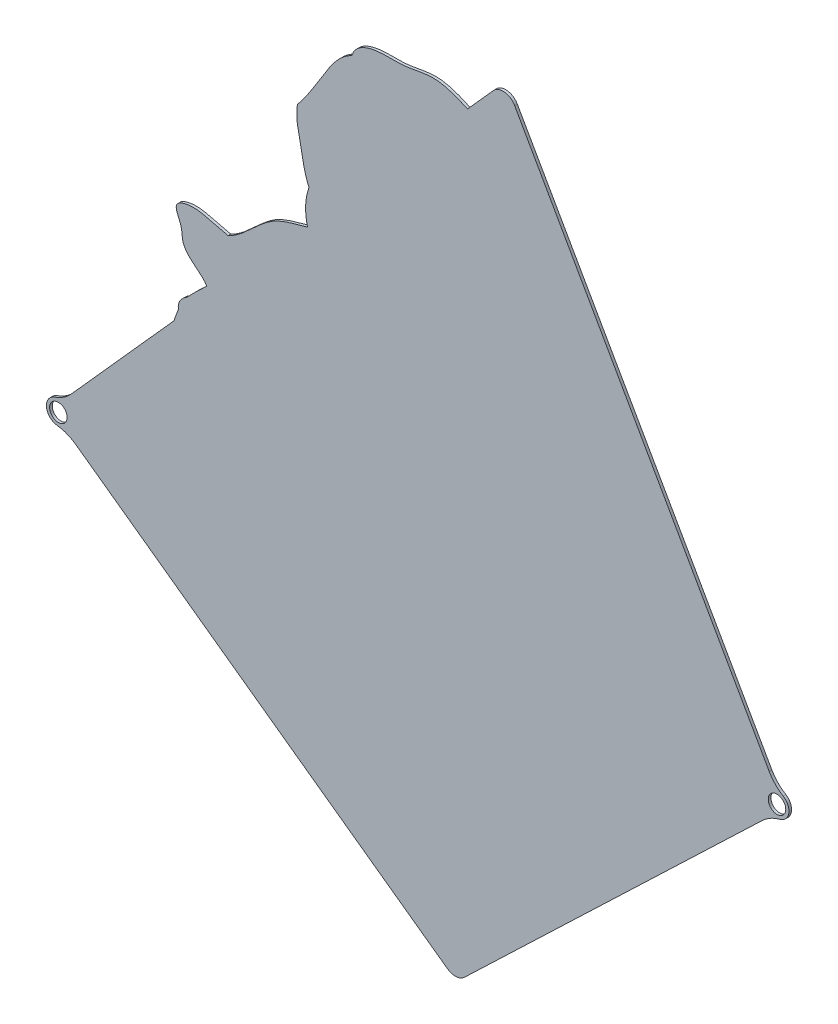
ISO-10303-21;
HEADER;
FILE_DESCRIPTION(('STEP AP214'),'2;1');
FILE_NAME('part.step','',(''),(''),'','','');
FILE_SCHEMA(('AUTOMOTIVE_DESIGN { 1 0 10303 214 1 1 1 1 }'));
ENDSEC;
DATA;
#1=APPLICATION_CONTEXT('core data for automotive mechanical design processes');
#2=APPLICATION_PROTOCOL_DEFINITION('international standard','automotive_design',2000,#1);
#3=PRODUCT_CONTEXT('',#1,'mechanical');
#4=PRODUCT('Part','Part','',(#3));
#5=PRODUCT_RELATED_PRODUCT_CATEGORY('part','',(#4));
#6=PRODUCT_DEFINITION_FORMATION('','',#4);
#7=PRODUCT_DEFINITION_CONTEXT('part definition',#1,'design');
#8=PRODUCT_DEFINITION('design','',#6,#7);
#9=PRODUCT_DEFINITION_SHAPE('','',#8);
#10=(LENGTH_UNIT() NAMED_UNIT(*) SI_UNIT(.MILLI.,.METRE.));
#11=(NAMED_UNIT(*) PLANE_ANGLE_UNIT() SI_UNIT($,.RADIAN.));
#12=(NAMED_UNIT(*) SI_UNIT($,.STERADIAN.) SOLID_ANGLE_UNIT());
#13=UNCERTAINTY_MEASURE_WITH_UNIT(LENGTH_MEASURE(1.E-05),#10,'distance_accuracy_value','');
#14=(GEOMETRIC_REPRESENTATION_CONTEXT(3) GLOBAL_UNCERTAINTY_ASSIGNED_CONTEXT((#13)) GLOBAL_UNIT_ASSIGNED_CONTEXT((#10,
#11,#12)) REPRESENTATION_CONTEXT('',''));
#15=CARTESIAN_POINT('',(0.,0.,0.));
#16=DIRECTION('',(0.,0.,1.));
#17=DIRECTION('',(1.,0.,0.));
#18=AXIS2_PLACEMENT_3D('',#15,#16,#17);
#19=CARTESIAN_POINT('',(59.9806161640926,171.840128470862,-4.));
#20=CARTESIAN_POINT('',(58.1352460402258,170.769655690411,-4.));
#21=CARTESIAN_POINT('',(56.3909211998731,168.715252621853,-4.));
#22=CARTESIAN_POINT('',(56.8872663364732,166.420330939957,-4.));
#23=B_SPLINE_CURVE_WITH_KNOTS('',3,(#19,#20,#21,#22),.UNSPECIFIED.,.F.,.F.,(4,4),(0.,1.),.UNSPECIFIED.);
#24=DIRECTION('',(0.,0.,1.));
#25=VECTOR('',#24,1.);
#26=SURFACE_OF_LINEAR_EXTRUSION('',#23,#25);
#27=CARTESIAN_POINT('',(59.9806161640926,171.840128470862,-3.));
#28=CARTESIAN_POINT('',(58.1352460402258,170.769655690411,-3.));
#29=CARTESIAN_POINT('',(56.3909211998731,168.715252621853,-3.));
#30=CARTESIAN_POINT('',(56.8872663364732,166.420330939957,-3.));
#31=B_SPLINE_CURVE_WITH_KNOTS('',3,(#27,#28,#29,#30),.UNSPECIFIED.,.F.,.F.,(4,4),(0.,1.),.UNSPECIFIED.);
#32=CARTESIAN_POINT('',(59.9806161634868,171.840128470425,-3.));
#33=VERTEX_POINT('',#32);
#34=CARTESIAN_POINT('',(56.8872663364732,166.420330939957,-3.));
#35=VERTEX_POINT('',#34);
#36=EDGE_CURVE('E352',#33,#35,#31,.T.);
#37=ORIENTED_EDGE('',*,*,#36,.F.);
#38=DIRECTION('',(0.,0.,1.));
#39=VECTOR('',#38,1.);
#40=CARTESIAN_POINT('',(59.9806161634868,171.840128470425,-4.));
#41=LINE('',#40,#39);
#42=CARTESIAN_POINT('',(59.9806161634868,171.840128470425,-4.));
#43=VERTEX_POINT('',#42);
#44=EDGE_CURVE('E11',#43,#33,#41,.T.);
#45=ORIENTED_EDGE('',*,*,#44,.F.);
#46=CARTESIAN_POINT('',(56.8872663364732,166.420330939957,-4.));
#47=VERTEX_POINT('',#46);
#48=EDGE_CURVE('E362',#43,#47,#23,.T.);
#49=ORIENTED_EDGE('',*,*,#48,.T.);
#50=DIRECTION('',(0.,0.,1.));
#51=VECTOR('',#50,1.);
#52=CARTESIAN_POINT('',(56.8872663364732,166.420330939957,-4.));
#53=LINE('',#52,#51);
#54=EDGE_CURVE('E43',#47,#35,#53,.T.);
#55=ORIENTED_EDGE('',*,*,#54,.T.);
#56=EDGE_LOOP('',(#37,#45,#49,#55));
#57=FACE_BOUND('',#56,.T.);
#58=ADVANCED_FACE('F39',(#57),#26,.T.);
#59=CARTESIAN_POINT('',(709360.629520317,-704976.409241836,-4.));
#60=CARTESIAN_POINT('',(-695963.860199664,718190.671949546,-4.));
#61=CARTESIAN_POINT('',(682824.682968235,-730699.805492577,-4.));
#62=B_SPLINE_CURVE_WITH_KNOTS('',2,(#59,#60,#61),.UNSPECIFIED.,.F.,.F.,(3,3),(0.,1.),.UNSPECIFIED.);
#63=DIRECTION('',(0.,0.,1.));
#64=VECTOR('',#63,1.);
#65=SURFACE_OF_LINEAR_EXTRUSION('',#62,#64);
#66=CARTESIAN_POINT('',(709360.629520317,-704976.409241836,-3.));
#67=CARTESIAN_POINT('',(-695963.860199664,718190.671949546,-3.));
#68=CARTESIAN_POINT('',(682824.682968235,-730699.805492577,-3.));
#69=B_SPLINE_CURVE_WITH_KNOTS('',2,(#66,#67,#68),.UNSPECIFIED.,.F.,.F.,(3,3),(0.,1.),.UNSPECIFIED.);
#70=CARTESIAN_POINT('',(67.5511590329545,179.262120632522,-3.));
#71=VERTEX_POINT('',#70);
#72=EDGE_CURVE('E360',#71,#33,#69,.T.);
#73=ORIENTED_EDGE('',*,*,#72,.F.);
#74=DIRECTION('',(0.,0.,1.));
#75=VECTOR('',#74,1.);
#76=CARTESIAN_POINT('',(67.5511590329545,179.262120632522,-4.));
#77=LINE('',#76,#75);
#78=CARTESIAN_POINT('',(67.5511590329545,179.262120632522,-4.));
#79=VERTEX_POINT('',#78);
#80=EDGE_CURVE('E50',#79,#71,#77,.T.);
#81=ORIENTED_EDGE('',*,*,#80,.F.);
#82=EDGE_CURVE('E213',#79,#43,#62,.T.);
#83=ORIENTED_EDGE('',*,*,#82,.T.);
#84=ORIENTED_EDGE('',*,*,#44,.T.);
#85=EDGE_LOOP('',(#73,#81,#83,#84));
#86=FACE_BOUND('',#85,.T.);
#87=ADVANCED_FACE('F347',(#86),#65,.T.);
#88=CARTESIAN_POINT('',(75.6084310687586,199.787338703665,-4.));
#89=CARTESIAN_POINT('',(72.9650083766247,200.448410696032,-4.));
#90=CARTESIAN_POINT('',(68.1301058964633,201.670017190916,-4.));
#91=CARTESIAN_POINT('',(62.0197575043796,202.966820343175,-4.));
#92=CARTESIAN_POINT('',(54.8350116235169,201.049857450651,-4.));
#93=CARTESIAN_POINT('',(56.9212553230008,196.431484587131,-4.));
#94=CARTESIAN_POINT('',(58.3216430822597,193.178691109802,-4.));
#95=CARTESIAN_POINT('',(58.0823213688219,189.161546227105,-4.));
#96=CARTESIAN_POINT('',(61.7573894763583,184.075704484428,-4.));
#97=CARTESIAN_POINT('',(65.8515580736938,182.053410845919,-4.));
#98=CARTESIAN_POINT('',(67.5511590329545,179.262120632522,-4.));
#99=B_SPLINE_CURVE_WITH_KNOTS('',3,(#88,#89,#90,#91,#92,#93,#94,#95,#96,#97,#98),.UNSPECIFIED.,
.F.,.F.,(4,1,1,1,1,1,1,1,4),(0.,0.185122605873872,0.320265005146591,0.454108381275894,
0.53728892639634,0.59917769050058,0.700070157561732,0.79019697526098,1.),.UNSPECIFIED.);
#100=DIRECTION('',(0.,0.,1.));
#101=VECTOR('',#100,1.);
#102=SURFACE_OF_LINEAR_EXTRUSION('',#99,#101);
#103=CARTESIAN_POINT('',(75.6084310687586,199.787338703665,-3.));
#104=CARTESIAN_POINT('',(72.9650083766247,200.448410696032,-3.));
#105=CARTESIAN_POINT('',(68.1301058964633,201.670017190916,-3.));
#106=CARTESIAN_POINT('',(62.0197575043796,202.966820343175,-3.));
#107=CARTESIAN_POINT('',(54.8350116235169,201.049857450651,-3.));
#108=CARTESIAN_POINT('',(56.9212553230008,196.431484587131,-3.));
#109=CARTESIAN_POINT('',(58.3216430822597,193.178691109802,-3.));
#110=CARTESIAN_POINT('',(58.0823213688219,189.161546227105,-3.));
#111=CARTESIAN_POINT('',(61.7573894763583,184.075704484428,-3.));
#112=CARTESIAN_POINT('',(65.8515580736938,182.053410845919,-3.));
#113=CARTESIAN_POINT('',(67.5511590329545,179.262120632522,-3.));
#114=B_SPLINE_CURVE_WITH_KNOTS('',3,(#103,#104,#105,#106,#107,#108,#109,#110,#111,#112,#113),
.UNSPECIFIED.,.F.,.F.,(4,1,1,1,1,1,1,1,4),(0.,0.185122605873872,0.320265005146591,
0.454108381275894,0.53728892639634,0.59917769050058,0.700070157561732,0.79019697526098,1.),.UNSPECIFIED.);
#115=CARTESIAN_POINT('',(75.6084310687586,199.787338703665,-3.));
#116=VERTEX_POINT('',#115);
#117=EDGE_CURVE('E199',#116,#71,#114,.T.);
#118=ORIENTED_EDGE('',*,*,#117,.F.);
#119=DIRECTION('',(0.,0.,1.));
#120=VECTOR('',#119,1.);
#121=CARTESIAN_POINT('',(75.6084310687586,199.787338703665,-4.));
#122=LINE('',#121,#120);
#123=CARTESIAN_POINT('',(75.6084310687586,199.787338703665,-4.));
#124=VERTEX_POINT('',#123);
#125=EDGE_CURVE('E194',#124,#116,#122,.T.);
#126=ORIENTED_EDGE('',*,*,#125,.F.);
#127=EDGE_CURVE('E197',#124,#79,#99,.T.);
#128=ORIENTED_EDGE('',*,*,#127,.T.);
#129=ORIENTED_EDGE('',*,*,#80,.T.);
#130=EDGE_LOOP('',(#118,#126,#128,#129));
#131=FACE_BOUND('',#130,.T.);
#132=ADVANCED_FACE('F196',(#131),#102,.T.);
#133=CARTESIAN_POINT('',(105.543362438897,217.548369999413,-4.));
#134=CARTESIAN_POINT('',(101.478949420785,216.275176704131,-4.));
#135=CARTESIAN_POINT('',(89.4383296670491,214.004143017136,-4.));
#136=CARTESIAN_POINT('',(82.364872067757,202.984357934411,-4.));
#137=CARTESIAN_POINT('',(75.6084310687586,199.787338703665,-4.));
#138=B_SPLINE_CURVE_WITH_KNOTS('',3,(#133,#134,#135,#136,#137),.UNSPECIFIED.,.F.,.F.,(4,1,4),
(0.,0.364395460525438,1.),.UNSPECIFIED.);
#139=DIRECTION('',(0.,0.,1.));
#140=VECTOR('',#139,1.);
#141=SURFACE_OF_LINEAR_EXTRUSION('',#138,#140);
#142=CARTESIAN_POINT('',(105.543362438897,217.548369999413,-3.));
#143=CARTESIAN_POINT('',(101.478949420785,216.275176704131,-3.));
#144=CARTESIAN_POINT('',(89.4383296670491,214.004143017136,-3.));
#145=CARTESIAN_POINT('',(82.364872067757,202.984357934411,-3.));
#146=CARTESIAN_POINT('',(75.6084310687586,199.787338703665,-3.));
#147=B_SPLINE_CURVE_WITH_KNOTS('',3,(#142,#143,#144,#145,#146),.UNSPECIFIED.,.F.,.F.,(4,1,4),
(0.,0.364395460525438,1.),.UNSPECIFIED.);
#148=CARTESIAN_POINT('',(105.54336243998,217.548369995308,-3.));
#149=VERTEX_POINT('',#148);
#150=EDGE_CURVE('E367',#149,#116,#147,.T.);
#151=ORIENTED_EDGE('',*,*,#150,.F.);
#152=DIRECTION('',(0.,0.,1.));
#153=VECTOR('',#152,1.);
#154=CARTESIAN_POINT('',(105.54336243998,217.548369995308,-4.));
#155=LINE('',#154,#153);
#156=CARTESIAN_POINT('',(105.54336243998,217.548369995308,-4.));
#157=VERTEX_POINT('',#156);
#158=EDGE_CURVE('E205',#157,#149,#155,.T.);
#159=ORIENTED_EDGE('',*,*,#158,.F.);
#160=EDGE_CURVE('E211',#157,#124,#138,.T.);
#161=ORIENTED_EDGE('',*,*,#160,.T.);
#162=ORIENTED_EDGE('',*,*,#125,.T.);
#163=EDGE_LOOP('',(#151,#159,#161,#162));
#164=FACE_BOUND('',#163,.T.);
#165=ADVANCED_FACE('F216',(#164),#141,.T.);
#166=CARTESIAN_POINT('',(999508.304164324,-34935.341637285,-4.));
#167=CARTESIAN_POINT('',(-999023.155523767,41977.300550128,-4.));
#168=CARTESIAN_POINT('',(998957.227715993,-48122.3003389059,-4.));
#169=B_SPLINE_CURVE_WITH_KNOTS('',2,(#166,#167,#168),.UNSPECIFIED.,.F.,.F.,(3,3),(0.,1.),.UNSPECIFIED.);
#170=DIRECTION('',(0.,0.,1.));
#171=VECTOR('',#170,1.);
#172=SURFACE_OF_LINEAR_EXTRUSION('',#169,#171);
#173=CARTESIAN_POINT('',(999508.304164324,-34935.341637285,-3.));
#174=CARTESIAN_POINT('',(-999023.155523767,41977.300550128,-3.));
#175=CARTESIAN_POINT('',(998957.227715993,-48122.3003389059,-3.));
#176=B_SPLINE_CURVE_WITH_KNOTS('',2,(#173,#174,#175),.UNSPECIFIED.,.F.,.F.,(3,3),(0.,1.),.UNSPECIFIED.);
#177=CARTESIAN_POINT('',(106.075647571718,230.779395719416,-3.));
#178=VERTEX_POINT('',#177);
#179=EDGE_CURVE('E577',#178,#149,#176,.T.);
#180=ORIENTED_EDGE('',*,*,#179,.F.);
#181=DIRECTION('',(0.,0.,1.));
#182=VECTOR('',#181,1.);
#183=CARTESIAN_POINT('',(106.075647571718,230.779395719416,-4.));
#184=LINE('',#183,#182);
#185=CARTESIAN_POINT('',(106.075647571718,230.779395719416,-4.));
#186=VERTEX_POINT('',#185);
#187=EDGE_CURVE('E382',#186,#178,#184,.T.);
#188=ORIENTED_EDGE('',*,*,#187,.F.);
#189=EDGE_CURVE('E218',#186,#157,#169,.T.);
#190=ORIENTED_EDGE('',*,*,#189,.T.);
#191=ORIENTED_EDGE('',*,*,#158,.T.);
#192=EDGE_LOOP('',(#180,#188,#190,#191));
#193=FACE_BOUND('',#192,.T.);
#194=ADVANCED_FACE('F241',(#193),#172,.T.);
#195=CARTESIAN_POINT('',(101.70383105617,255.636584821424,-4.));
#196=CARTESIAN_POINT('',(100.938919323461,251.235797265688,-4.));
#197=CARTESIAN_POINT('',(103.183355148142,242.927772517398,-4.));
#198=CARTESIAN_POINT('',(104.330566520143,234.54393808348,-4.));
#199=CARTESIAN_POINT('',(106.075647571718,230.779395719416,-4.));
#200=B_SPLINE_CURVE_WITH_KNOTS('',3,(#195,#196,#197,#198,#199),.UNSPECIFIED.,.F.,.F.,(4,1,4),
(0.,0.517213565292477,1.),.UNSPECIFIED.);
#201=DIRECTION('',(0.,0.,1.));
#202=VECTOR('',#201,1.);
#203=SURFACE_OF_LINEAR_EXTRUSION('',#200,#202);
#204=CARTESIAN_POINT('',(101.70383105617,255.636584821424,-3.));
#205=CARTESIAN_POINT('',(100.938919323461,251.235797265688,-3.));
#206=CARTESIAN_POINT('',(103.183355148142,242.927772517398,-3.));
#207=CARTESIAN_POINT('',(104.330566520143,234.54393808348,-3.));
#208=CARTESIAN_POINT('',(106.075647571718,230.779395719416,-3.));
#209=B_SPLINE_CURVE_WITH_KNOTS('',3,(#204,#205,#206,#207,#208),.UNSPECIFIED.,.F.,.F.,(4,1,4),
(0.,0.517213565292477,1.),.UNSPECIFIED.);
#210=CARTESIAN_POINT('',(101.70383105617,255.636584821424,-3.));
#211=VERTEX_POINT('',#210);
#212=EDGE_CURVE('E568',#211,#178,#209,.T.);
#213=ORIENTED_EDGE('',*,*,#212,.F.);
#214=DIRECTION('',(0.,0.,1.));
#215=VECTOR('',#214,1.);
#216=CARTESIAN_POINT('',(101.70383105617,255.636584821424,-4.));
#217=LINE('',#216,#215);
#218=CARTESIAN_POINT('',(101.70383105617,255.636584821424,-4.));
#219=VERTEX_POINT('',#218);
#220=EDGE_CURVE('E385',#219,#211,#217,.T.);
#221=ORIENTED_EDGE('',*,*,#220,.F.);
#222=EDGE_CURVE('E221',#219,#186,#200,.T.);
#223=ORIENTED_EDGE('',*,*,#222,.T.);
#224=ORIENTED_EDGE('',*,*,#187,.T.);
#225=EDGE_LOOP('',(#213,#221,#223,#224));
#226=FACE_BOUND('',#225,.T.);
#227=ADVANCED_FACE('F245',(#226),#203,.T.);
#228=CARTESIAN_POINT('',(122.229813511787,281.878394701799,-4.));
#229=CARTESIAN_POINT('',(118.058976154974,279.823016138493,-4.));
#230=CARTESIAN_POINT('',(111.235657544432,270.739838071113,-4.));
#231=CARTESIAN_POINT('',(106.106560936776,260.813884877418,-4.));
#232=CARTESIAN_POINT('',(101.70383105617,255.636584821424,-4.));
#233=B_SPLINE_CURVE_WITH_KNOTS('',3,(#228,#229,#230,#231,#232),.UNSPECIFIED.,.F.,.F.,(4,1,4),
(0.,0.398895915220545,1.),.UNSPECIFIED.);
#234=DIRECTION('',(0.,0.,1.));
#235=VECTOR('',#234,1.);
#236=SURFACE_OF_LINEAR_EXTRUSION('',#233,#235);
#237=CARTESIAN_POINT('',(122.229813511787,281.878394701799,-3.));
#238=CARTESIAN_POINT('',(118.058976154974,279.823016138493,-3.));
#239=CARTESIAN_POINT('',(111.235657544432,270.739838071113,-3.));
#240=CARTESIAN_POINT('',(106.106560936776,260.813884877418,-3.));
#241=CARTESIAN_POINT('',(101.70383105617,255.636584821424,-3.));
#242=B_SPLINE_CURVE_WITH_KNOTS('',3,(#237,#238,#239,#240,#241),.UNSPECIFIED.,.F.,.F.,(4,1,4),
(0.,0.398895915220545,1.),.UNSPECIFIED.);
#243=CARTESIAN_POINT('',(122.229813511787,281.878394701799,-3.));
#244=VERTEX_POINT('',#243);
#245=EDGE_CURVE('E545',#244,#211,#242,.T.);
#246=ORIENTED_EDGE('',*,*,#245,.F.);
#247=DIRECTION('',(0.,0.,1.));
#248=VECTOR('',#247,1.);
#249=CARTESIAN_POINT('',(122.229813511787,281.878394701799,-4.));
#250=LINE('',#249,#248);
#251=CARTESIAN_POINT('',(122.229813511787,281.878394701799,-4.));
#252=VERTEX_POINT('',#251);
#253=EDGE_CURVE('E388',#252,#244,#250,.T.);
#254=ORIENTED_EDGE('',*,*,#253,.F.);
#255=EDGE_CURVE('E258',#252,#219,#233,.T.);
#256=ORIENTED_EDGE('',*,*,#255,.T.);
#257=ORIENTED_EDGE('',*,*,#220,.T.);
#258=EDGE_LOOP('',(#246,#254,#256,#257));
#259=FACE_BOUND('',#258,.T.);
#260=ADVANCED_FACE('F249',(#259),#236,.T.);
#261=CARTESIAN_POINT('',(165.847660097822,286.247140349205,-4.));
#262=CARTESIAN_POINT('',(161.95895127484,288.053215105295,-4.));
#263=CARTESIAN_POINT('',(153.754186300141,291.385632032382,-4.));
#264=CARTESIAN_POINT('',(142.949710048504,287.922349017421,-4.));
#265=CARTESIAN_POINT('',(132.088667549783,288.696875057958,-4.));
#266=CARTESIAN_POINT('',(123.730011037869,286.762274271107,-4.));
#267=CARTESIAN_POINT('',(122.229813511787,281.878394701799,-4.));
#268=B_SPLINE_CURVE_WITH_KNOTS('',3,(#261,#262,#263,#264,#265,#266,#267),.UNSPECIFIED.,.F.,.F.,
(4,1,1,1,4),(0.,0.282569955805388,0.534959136880891,0.697744118302275,1.),.UNSPECIFIED.);
#269=DIRECTION('',(0.,0.,1.));
#270=VECTOR('',#269,1.);
#271=SURFACE_OF_LINEAR_EXTRUSION('',#268,#270);
#272=CARTESIAN_POINT('',(165.847660097822,286.247140349205,-3.));
#273=CARTESIAN_POINT('',(161.95895127484,288.053215105295,-3.));
#274=CARTESIAN_POINT('',(153.754186300141,291.385632032382,-3.));
#275=CARTESIAN_POINT('',(142.949710048504,287.922349017421,-3.));
#276=CARTESIAN_POINT('',(132.088667549783,288.696875057958,-3.));
#277=CARTESIAN_POINT('',(123.730011037869,286.762274271107,-3.));
#278=CARTESIAN_POINT('',(122.229813511787,281.878394701799,-3.));
#279=B_SPLINE_CURVE_WITH_KNOTS('',3,(#272,#273,#274,#275,#276,#277,#278),.UNSPECIFIED.,.F.,.F.,
(4,1,1,1,4),(0.,0.282569955805388,0.534959136880891,0.697744118302275,1.),.UNSPECIFIED.);
#280=CARTESIAN_POINT('',(165.847660097822,286.247140349205,-3.));
#281=VERTEX_POINT('',#280);
#282=EDGE_CURVE('E541',#281,#244,#279,.T.);
#283=ORIENTED_EDGE('',*,*,#282,.F.);
#284=DIRECTION('',(0.,0.,1.));
#285=VECTOR('',#284,1.);
#286=CARTESIAN_POINT('',(165.847660097822,286.247140349205,-4.));
#287=LINE('',#286,#285);
#288=CARTESIAN_POINT('',(165.847660097822,286.247140349205,-4.));
#289=VERTEX_POINT('',#288);
#290=EDGE_CURVE('E391',#289,#281,#287,.T.);
#291=ORIENTED_EDGE('',*,*,#290,.F.);
#292=EDGE_CURVE('E268',#289,#252,#268,.T.);
#293=ORIENTED_EDGE('',*,*,#292,.T.);
#294=ORIENTED_EDGE('',*,*,#253,.T.);
#295=EDGE_LOOP('',(#283,#291,#293,#294));
#296=FACE_BOUND('',#295,.T.);
#297=ADVANCED_FACE('F283',(#296),#271,.T.);
#298=CARTESIAN_POINT('',(175.53054565257,297.07824100228,-4.));
#299=DIRECTION('',(-0.745518274322445,0.666485185620269,0.));
#300=DIRECTION('',(-0.666485185620269,-0.745518274322445,0.));
#301=AXIS2_PLACEMENT_3D('',#298,#299,#300);
#302=PLANE('',#301);
#303=DIRECTION('',(-0.666485185620269,-0.745518274322445,0.));
#304=VECTOR('',#303,1.);
#305=CARTESIAN_POINT('',(175.53054565257,297.07824100228,-3.));
#306=LINE('',#305,#304);
#307=CARTESIAN_POINT('',(175.53054565257,297.07824100228,-3.));
#308=VERTEX_POINT('',#307);
#309=EDGE_CURVE('E546',#308,#281,#306,.T.);
#310=ORIENTED_EDGE('',*,*,#309,.F.);
#311=DIRECTION('',(0.,0.,1.));
#312=VECTOR('',#311,1.);
#313=CARTESIAN_POINT('',(175.53054565257,297.07824100228,-4.));
#314=LINE('',#313,#312);
#315=CARTESIAN_POINT('',(175.53054565257,297.07824100228,-4.));
#316=VERTEX_POINT('',#315);
#317=EDGE_CURVE('E394',#316,#308,#314,.T.);
#318=ORIENTED_EDGE('',*,*,#317,.F.);
#319=DIRECTION('',(-0.666485185620269,-0.745518274322445,0.));
#320=VECTOR('',#319,1.);
#321=CARTESIAN_POINT('',(175.53054565257,297.07824100228,-4.));
#322=LINE('',#321,#320);
#323=EDGE_CURVE('E278',#316,#289,#322,.T.);
#324=ORIENTED_EDGE('',*,*,#323,.T.);
#325=ORIENTED_EDGE('',*,*,#290,.T.);
#326=EDGE_LOOP('',(#310,#318,#324,#325));
#327=FACE_BOUND('',#326,.T.);
#328=ADVANCED_FACE('F286',(#327),#302,.T.);
#329=CARTESIAN_POINT('',(179.258137024183,293.745815074178,-4.));
#330=DIRECTION('',(0.,0.,1.));
#331=DIRECTION('',(1.,0.,0.));
#332=AXIS2_PLACEMENT_3D('',#329,#330,#331);
#333=CYLINDRICAL_SURFACE('',#332,5.00000000000065);
#334=CARTESIAN_POINT('',(179.258137024183,293.745815074178,-3.));
#335=DIRECTION('',(0.,0.,1.));
#336=DIRECTION('',(1.,0.,0.));
#337=AXIS2_PLACEMENT_3D('',#334,#335,#336);
#338=CIRCLE('',#337,5.00000000000065);
#339=CARTESIAN_POINT('',(183.608668269553,296.210136052267,-3.));
#340=VERTEX_POINT('',#339);
#341=EDGE_CURVE('E551',#340,#308,#338,.T.);
#342=ORIENTED_EDGE('',*,*,#341,.F.);
#343=DIRECTION('',(0.,0.,1.));
#344=VECTOR('',#343,1.);
#345=CARTESIAN_POINT('',(183.608668269553,296.210136052267,-4.));
#346=LINE('',#345,#344);
#347=CARTESIAN_POINT('',(183.608668269553,296.210136052267,-4.));
#348=VERTEX_POINT('',#347);
#349=EDGE_CURVE('E397',#348,#340,#346,.T.);
#350=ORIENTED_EDGE('',*,*,#349,.F.);
#351=CARTESIAN_POINT('',(179.258137024183,293.745815074178,-4.));
#352=DIRECTION('',(0.,0.,1.));
#353=DIRECTION('',(1.,0.,0.));
#354=AXIS2_PLACEMENT_3D('',#351,#352,#353);
#355=CIRCLE('',#354,5.00000000000065);
#356=EDGE_CURVE('E526',#348,#316,#355,.T.);
#357=ORIENTED_EDGE('',*,*,#356,.T.);
#358=ORIENTED_EDGE('',*,*,#317,.T.);
#359=EDGE_LOOP('',(#342,#350,#357,#358));
#360=FACE_BOUND('',#359,.T.);
#361=ADVANCED_FACE('F290',(#360),#333,.T.);
#362=CARTESIAN_POINT('',(279.513330180004,126.899306850898,-4.));
#363=DIRECTION('',(0.870106249074433,0.492864195617434,0.));
#364=DIRECTION('',(-0.492864195617434,0.870106249074433,0.));
#365=AXIS2_PLACEMENT_3D('',#362,#363,#364);
#366=PLANE('',#365);
#367=DIRECTION('',(-0.492864195617434,0.870106249074433,0.));
#368=VECTOR('',#367,1.);
#369=CARTESIAN_POINT('',(279.513330180004,126.899306850898,-3.));
#370=LINE('',#369,#368);
#371=CARTESIAN_POINT('',(279.513330180004,126.899306850898,-3.));
#372=VERTEX_POINT('',#371);
#373=EDGE_CURVE('E555',#372,#340,#370,.T.);
#374=ORIENTED_EDGE('',*,*,#373,.F.);
#375=DIRECTION('',(0.,0.,1.));
#376=VECTOR('',#375,1.);
#377=CARTESIAN_POINT('',(279.513330180004,126.899306850898,-4.));
#378=LINE('',#377,#376);
#379=CARTESIAN_POINT('',(279.513330180004,126.899306850898,-4.));
#380=VERTEX_POINT('',#379);
#381=EDGE_CURVE('E400',#380,#372,#378,.T.);
#382=ORIENTED_EDGE('',*,*,#381,.F.);
#383=DIRECTION('',(-0.492864195617434,0.870106249074433,0.));
#384=VECTOR('',#383,1.);
#385=CARTESIAN_POINT('',(279.513330180004,126.899306850898,-4.));
#386=LINE('',#385,#384);
#387=EDGE_CURVE('E523',#380,#348,#386,.T.);
#388=ORIENTED_EDGE('',*,*,#387,.T.);
#389=ORIENTED_EDGE('',*,*,#349,.T.);
#390=EDGE_LOOP('',(#374,#382,#388,#389));
#391=FACE_BOUND('',#390,.T.);
#392=ADVANCED_FACE('F294',(#391),#366,.T.);
#393=CARTESIAN_POINT('',(292.56492391612,134.29226978516,-4.));
#394=DIRECTION('',(0.,0.,1.));
#395=DIRECTION('',(1.,0.,0.));
#396=AXIS2_PLACEMENT_3D('',#393,#394,#395);
#397=CYLINDRICAL_SURFACE('',#396,15.);
#398=CARTESIAN_POINT('',(292.56492391612,134.29226978516,-3.));
#399=DIRECTION('',(0.,0.,-1.));
#400=DIRECTION('',(1.,0.,0.));
#401=AXIS2_PLACEMENT_3D('',#398,#399,#400);
#402=CIRCLE('',#401,15.);
#403=CARTESIAN_POINT('',(284.808210365133,121.453523939559,-3.));
#404=VERTEX_POINT('',#403);
#405=EDGE_CURVE('E751',#404,#372,#402,.T.);
#406=ORIENTED_EDGE('',*,*,#405,.F.);
#407=DIRECTION('',(0.,0.,1.));
#408=VECTOR('',#407,1.);
#409=CARTESIAN_POINT('',(284.808210365133,121.453523939559,-4.));
#410=LINE('',#409,#408);
#411=CARTESIAN_POINT('',(284.808210365133,121.453523939559,-4.));
#412=VERTEX_POINT('',#411);
#413=EDGE_CURVE('E403',#412,#404,#410,.T.);
#414=ORIENTED_EDGE('',*,*,#413,.F.);
#415=CARTESIAN_POINT('',(292.56492391612,134.29226978516,-4.));
#416=DIRECTION('',(0.,0.,-1.));
#417=DIRECTION('',(1.,0.,0.));
#418=AXIS2_PLACEMENT_3D('',#415,#416,#417);
#419=CIRCLE('',#418,15.);
#420=EDGE_CURVE('E519',#412,#380,#419,.T.);
#421=ORIENTED_EDGE('',*,*,#420,.T.);
#422=ORIENTED_EDGE('',*,*,#381,.T.);
#423=EDGE_LOOP('',(#406,#414,#421,#422));
#424=FACE_BOUND('',#423,.T.);
#425=ADVANCED_FACE('F298',(#424),#397,.F.);
#426=CARTESIAN_POINT('',(282.481196299837,117.601900185879,-4.));
#427=DIRECTION('',(0.,0.,1.));
#428=DIRECTION('',(1.,0.,0.));
#429=AXIS2_PLACEMENT_3D('',#426,#427,#428);
#430=CYLINDRICAL_SURFACE('',#429,4.50000000000002);
#431=CARTESIAN_POINT('',(282.481196299837,117.601900185879,-3.));
#432=DIRECTION('',(0.,0.,1.));
#433=DIRECTION('',(1.,0.,0.));
#434=AXIS2_PLACEMENT_3D('',#431,#432,#433);
#435=CIRCLE('',#434,4.50000000000002);
#436=CARTESIAN_POINT('',(283.598320346634,113.242767948372,-3.));
#437=VERTEX_POINT('',#436);
#438=EDGE_CURVE('E755',#437,#404,#435,.T.);
#439=ORIENTED_EDGE('',*,*,#438,.F.);
#440=DIRECTION('',(0.,0.,1.));
#441=VECTOR('',#440,1.);
#442=CARTESIAN_POINT('',(283.598320346634,113.242767948372,-4.));
#443=LINE('',#442,#441);
#444=CARTESIAN_POINT('',(283.598320346634,113.242767948372,-4.));
#445=VERTEX_POINT('',#444);
#446=EDGE_CURVE('E406',#445,#437,#443,.T.);
#447=ORIENTED_EDGE('',*,*,#446,.F.);
#448=CARTESIAN_POINT('',(282.481196299837,117.601900185879,-4.));
#449=DIRECTION('',(0.,0.,1.));
#450=DIRECTION('',(1.,0.,0.));
#451=AXIS2_PLACEMENT_3D('',#448,#449,#450);
#452=CIRCLE('',#451,4.50000000000002);
#453=EDGE_CURVE('E515',#445,#412,#452,.T.);
#454=ORIENTED_EDGE('',*,*,#453,.T.);
#455=ORIENTED_EDGE('',*,*,#413,.T.);
#456=EDGE_LOOP('',(#439,#447,#454,#455));
#457=FACE_BOUND('',#456,.T.);
#458=ADVANCED_FACE('F302',(#457),#430,.T.);
#459=CARTESIAN_POINT('',(287.322067169293,98.7123271566846,-4.));
#460=DIRECTION('',(0.,0.,1.));
#461=DIRECTION('',(1.,0.,0.));
#462=AXIS2_PLACEMENT_3D('',#459,#460,#461);
#463=CYLINDRICAL_SURFACE('',#462,15.);
#464=CARTESIAN_POINT('',(287.322067169293,98.7123271566846,-3.));
#465=DIRECTION('',(0.,0.,-1.));
#466=DIRECTION('',(1.,0.,0.));
#467=AXIS2_PLACEMENT_3D('',#464,#465,#466);
#468=CIRCLE('',#467,15.);
#469=CARTESIAN_POINT('',(276.95768066904,109.555734945446,-3.));
#470=VERTEX_POINT('',#469);
#471=EDGE_CURVE('E759',#470,#437,#468,.T.);
#472=ORIENTED_EDGE('',*,*,#471,.F.);
#473=DIRECTION('',(0.,0.,1.));
#474=VECTOR('',#473,1.);
#475=CARTESIAN_POINT('',(276.95768066904,109.555734945446,-4.));
#476=LINE('',#475,#474);
#477=CARTESIAN_POINT('',(276.95768066904,109.555734945446,-4.));
#478=VERTEX_POINT('',#477);
#479=EDGE_CURVE('E409',#478,#470,#476,.T.);
#480=ORIENTED_EDGE('',*,*,#479,.F.);
#481=CARTESIAN_POINT('',(287.322067169293,98.7123271566846,-4.));
#482=DIRECTION('',(0.,0.,-1.));
#483=DIRECTION('',(1.,0.,0.));
#484=AXIS2_PLACEMENT_3D('',#481,#482,#483);
#485=CIRCLE('',#484,15.);
#486=EDGE_CURVE('E511',#478,#445,#485,.T.);
#487=ORIENTED_EDGE('',*,*,#486,.T.);
#488=ORIENTED_EDGE('',*,*,#446,.T.);
#489=EDGE_LOOP('',(#472,#480,#487,#488));
#490=FACE_BOUND('',#489,.T.);
#491=ADVANCED_FACE('F306',(#490),#463,.F.);
#492=CARTESIAN_POINT('',(164.688165502771,2.24586796938245,-4.));
#493=DIRECTION('',(0.690959100016863,-0.722893852584103,0.));
#494=DIRECTION('',(0.722893852584103,0.690959100016863,0.));
#495=AXIS2_PLACEMENT_3D('',#492,#493,#494);
#496=PLANE('',#495);
#497=DIRECTION('',(0.722893852584102,0.690959100016863,0.));
#498=VECTOR('',#497,1.);
#499=CARTESIAN_POINT('',(164.688165502771,2.24586796938245,-3.));
#500=LINE('',#499,#498);
#501=CARTESIAN_POINT('',(164.688165502772,2.24586796938208,-3.));
#502=VERTEX_POINT('',#501);
#503=EDGE_CURVE('E763',#502,#470,#500,.T.);
#504=ORIENTED_EDGE('',*,*,#503,.F.);
#505=DIRECTION('',(0.,0.,1.));
#506=VECTOR('',#505,1.);
#507=CARTESIAN_POINT('',(164.688165502772,2.24586796938208,-4.));
#508=LINE('',#507,#506);
#509=CARTESIAN_POINT('',(164.688165502772,2.24586796938208,-4.));
#510=VERTEX_POINT('',#509);
#511=EDGE_CURVE('E412',#510,#502,#508,.T.);
#512=ORIENTED_EDGE('',*,*,#511,.F.);
#513=DIRECTION('',(0.722893852584102,0.690959100016863,0.));
#514=VECTOR('',#513,1.);
#515=CARTESIAN_POINT('',(164.688165502771,2.24586796938245,-4.));
#516=LINE('',#515,#514);
#517=EDGE_CURVE('E507',#510,#478,#516,.T.);
#518=ORIENTED_EDGE('',*,*,#517,.T.);
#519=ORIENTED_EDGE('',*,*,#479,.T.);
#520=EDGE_LOOP('',(#504,#512,#518,#519));
#521=FACE_BOUND('',#520,.T.);
#522=ADVANCED_FACE('F310',(#521),#496,.T.);
#523=CARTESIAN_POINT('',(161.233370002688,5.86033723230375,-4.));
#524=DIRECTION('',(0.,0.,1.));
#525=DIRECTION('',(1.,0.,0.));
#526=AXIS2_PLACEMENT_3D('',#523,#524,#525);
#527=CYLINDRICAL_SURFACE('',#526,5.00000000000045);
#528=CARTESIAN_POINT('',(161.233370002688,5.86033723230375,-3.));
#529=DIRECTION('',(0.,0.,1.));
#530=DIRECTION('',(1.,0.,0.));
#531=AXIS2_PLACEMENT_3D('',#528,#529,#530);
#532=CIRCLE('',#531,5.00000000000045);
#533=CARTESIAN_POINT('',(158.308378587161,1.80516458257551,-3.));
#534=VERTEX_POINT('',#533);
#535=EDGE_CURVE('E767',#534,#502,#532,.T.);
#536=ORIENTED_EDGE('',*,*,#535,.F.);
#537=DIRECTION('',(0.,0.,1.));
#538=VECTOR('',#537,1.);
#539=CARTESIAN_POINT('',(158.308378587161,1.80516458257551,-4.));
#540=LINE('',#539,#538);
#541=CARTESIAN_POINT('',(158.308378587161,1.80516458257551,-4.));
#542=VERTEX_POINT('',#541);
#543=EDGE_CURVE('E415',#542,#534,#540,.T.);
#544=ORIENTED_EDGE('',*,*,#543,.F.);
#545=CARTESIAN_POINT('',(161.233370002688,5.86033723230375,-4.));
#546=DIRECTION('',(0.,0.,1.));
#547=DIRECTION('',(1.,0.,0.));
#548=AXIS2_PLACEMENT_3D('',#545,#546,#547);
#549=CIRCLE('',#548,5.00000000000045);
#550=EDGE_CURVE('E503',#542,#510,#549,.T.);
#551=ORIENTED_EDGE('',*,*,#550,.T.);
#552=ORIENTED_EDGE('',*,*,#511,.T.);
#553=EDGE_LOOP('',(#536,#544,#551,#552));
#554=FACE_BOUND('',#553,.T.);
#555=ADVANCED_FACE('F314',(#554),#527,.T.);
#556=CARTESIAN_POINT('',(18.1894632957131,102.872778660035,-4.));
#557=DIRECTION('',(-0.584998283105054,-0.811034529945636,0.));
#558=DIRECTION('',(0.811034529945636,-0.584998283105054,0.));
#559=AXIS2_PLACEMENT_3D('',#556,#557,#558);
#560=PLANE('',#559);
#561=DIRECTION('',(0.811034529945636,-0.584998283105054,0.));
#562=VECTOR('',#561,1.);
#563=CARTESIAN_POINT('',(18.1894632957131,102.872778660035,-3.));
#564=LINE('',#563,#562);
#565=CARTESIAN_POINT('',(18.1894632957131,102.872778660035,-3.));
#566=VERTEX_POINT('',#565);
#567=EDGE_CURVE('E771',#566,#534,#564,.T.);
#568=ORIENTED_EDGE('',*,*,#567,.F.);
#569=DIRECTION('',(0.,0.,1.));
#570=VECTOR('',#569,1.);
#571=CARTESIAN_POINT('',(18.1894632957131,102.872778660035,-4.));
#572=LINE('',#571,#570);
#573=CARTESIAN_POINT('',(18.1894632957131,102.872778660035,-4.));
#574=VERTEX_POINT('',#573);
#575=EDGE_CURVE('E418',#574,#566,#572,.T.);
#576=ORIENTED_EDGE('',*,*,#575,.F.);
#577=DIRECTION('',(0.811034529945636,-0.584998283105054,0.));
#578=VECTOR('',#577,1.);
#579=CARTESIAN_POINT('',(18.1894632957131,102.872778660035,-4.));
#580=LINE('',#579,#578);
#581=EDGE_CURVE('E499',#574,#542,#580,.T.);
#582=ORIENTED_EDGE('',*,*,#581,.T.);
#583=ORIENTED_EDGE('',*,*,#543,.T.);
#584=EDGE_LOOP('',(#568,#576,#582,#583));
#585=FACE_BOUND('',#584,.T.);
#586=ADVANCED_FACE('F318',(#585),#560,.T.);
#587=CARTESIAN_POINT('',(9.41448904913725,90.7072607108509,-4.));
#588=DIRECTION('',(0.,0.,1.));
#589=DIRECTION('',(1.,0.,0.));
#590=AXIS2_PLACEMENT_3D('',#587,#588,#589);
#591=CYLINDRICAL_SURFACE('',#590,15.);
#592=CARTESIAN_POINT('',(9.41448904913725,90.7072607108509,-3.));
#593=DIRECTION('',(0.,0.,-1.));
#594=DIRECTION('',(1.,0.,0.));
#595=AXIS2_PLACEMENT_3D('',#592,#593,#594);
#596=CIRCLE('',#595,15.);
#597=CARTESIAN_POINT('',(11.1049308519574,105.611703220092,-3.));
#598=VERTEX_POINT('',#597);
#599=EDGE_CURVE('E775',#598,#566,#596,.T.);
#600=ORIENTED_EDGE('',*,*,#599,.F.);
#601=DIRECTION('',(0.,0.,1.));
#602=VECTOR('',#601,1.);
#603=CARTESIAN_POINT('',(11.1049308519574,105.611703220092,-4.));
#604=LINE('',#603,#602);
#605=CARTESIAN_POINT('',(11.1049308519574,105.611703220092,-4.));
#606=VERTEX_POINT('',#605);
#607=EDGE_CURVE('E421',#606,#598,#604,.T.);
#608=ORIENTED_EDGE('',*,*,#607,.F.);
#609=CARTESIAN_POINT('',(9.41448904913725,90.7072607108509,-4.));
#610=DIRECTION('',(0.,0.,-1.));
#611=DIRECTION('',(1.,0.,0.));
#612=AXIS2_PLACEMENT_3D('',#609,#610,#611);
#613=CIRCLE('',#612,15.);
#614=EDGE_CURVE('E495',#606,#574,#613,.T.);
#615=ORIENTED_EDGE('',*,*,#614,.T.);
#616=ORIENTED_EDGE('',*,*,#575,.T.);
#617=EDGE_LOOP('',(#600,#608,#615,#616));
#618=FACE_BOUND('',#617,.T.);
#619=ADVANCED_FACE('F322',(#618),#591,.F.);
#620=CARTESIAN_POINT('',(11.6120633928034,110.083035972865,-4.));
#621=DIRECTION('',(0.,0.,1.));
#622=DIRECTION('',(1.,0.,0.));
#623=AXIS2_PLACEMENT_3D('',#620,#621,#622);
#624=CYLINDRICAL_SURFACE('',#623,4.5);
#625=CARTESIAN_POINT('',(11.6120633928034,110.083035972865,-3.));
#626=DIRECTION('',(0.,0.,1.));
#627=DIRECTION('',(1.,0.,0.));
#628=AXIS2_PLACEMENT_3D('',#625,#626,#627);
#629=CIRCLE('',#628,4.5);
#630=CARTESIAN_POINT('',(10.1582394989721,114.341720756425,-3.));
#631=VERTEX_POINT('',#630);
#632=EDGE_CURVE('E779',#631,#598,#629,.T.);
#633=ORIENTED_EDGE('',*,*,#632,.F.);
#634=DIRECTION('',(0.,0.,1.));
#635=VECTOR('',#634,1.);
#636=CARTESIAN_POINT('',(10.1582394989721,114.341720756425,-4.));
#637=LINE('',#636,#635);
#638=CARTESIAN_POINT('',(10.1582394989721,114.341720756425,-4.));
#639=VERTEX_POINT('',#638);
#640=EDGE_CURVE('E424',#639,#631,#637,.T.);
#641=ORIENTED_EDGE('',*,*,#640,.F.);
#642=CARTESIAN_POINT('',(11.6120633928034,110.083035972865,-4.));
#643=DIRECTION('',(0.,0.,1.));
#644=DIRECTION('',(1.,0.,0.));
#645=AXIS2_PLACEMENT_3D('',#642,#643,#644);
#646=CIRCLE('',#645,4.5);
#647=EDGE_CURVE('E491',#639,#606,#646,.T.);
#648=ORIENTED_EDGE('',*,*,#647,.T.);
#649=ORIENTED_EDGE('',*,*,#607,.T.);
#650=EDGE_LOOP('',(#633,#641,#648,#649));
#651=FACE_BOUND('',#650,.T.);
#652=ADVANCED_FACE('F326',(#651),#624,.T.);
#653=CARTESIAN_POINT('',(5.31215985286758,128.537336701624,-4.));
#654=DIRECTION('',(0.,0.,1.));
#655=DIRECTION('',(1.,0.,0.));
#656=AXIS2_PLACEMENT_3D('',#653,#654,#655);
#657=CYLINDRICAL_SURFACE('',#656,15.);
#658=CARTESIAN_POINT('',(5.31215985286758,128.537336701624,-3.));
#659=DIRECTION('',(0.,0.,-1.));
#660=DIRECTION('',(1.,0.,0.));
#661=AXIS2_PLACEMENT_3D('',#658,#659,#660);
#662=CIRCLE('',#661,15.);
#663=CARTESIAN_POINT('',(16.4909693348344,118.535625919669,-3.));
#664=VERTEX_POINT('',#663);
#665=EDGE_CURVE('E783',#664,#631,#662,.T.);
#666=ORIENTED_EDGE('',*,*,#665,.F.);
#667=DIRECTION('',(0.,0.,1.));
#668=VECTOR('',#667,1.);
#669=CARTESIAN_POINT('',(16.4909693348344,118.535625919669,-4.));
#670=LINE('',#669,#668);
#671=CARTESIAN_POINT('',(16.4909693348344,118.535625919669,-4.));
#672=VERTEX_POINT('',#671);
#673=EDGE_CURVE('E427',#672,#664,#670,.T.);
#674=ORIENTED_EDGE('',*,*,#673,.F.);
#675=CARTESIAN_POINT('',(5.31215985286758,128.537336701624,-4.));
#676=DIRECTION('',(0.,0.,-1.));
#677=DIRECTION('',(1.,0.,0.));
#678=AXIS2_PLACEMENT_3D('',#675,#676,#677);
#679=CIRCLE('',#678,15.);
#680=EDGE_CURVE('E487',#672,#639,#679,.T.);
#681=ORIENTED_EDGE('',*,*,#680,.T.);
#682=ORIENTED_EDGE('',*,*,#640,.T.);
#683=EDGE_LOOP('',(#666,#674,#681,#682));
#684=FACE_BOUND('',#683,.T.);
#685=ADVANCED_FACE('F330',(#684),#657,.F.);
#686=CARTESIAN_POINT('',(55.1561591253377,161.75131168334,-4.));
#687=DIRECTION('',(-0.745253965464454,0.666780718797047,0.));
#688=DIRECTION('',(-0.666780718797047,-0.745253965464454,0.));
#689=AXIS2_PLACEMENT_3D('',#686,#687,#688);
#690=PLANE('',#689);
#691=DIRECTION('',(-0.666780718797047,-0.745253965464454,0.));
#692=VECTOR('',#691,1.);
#693=CARTESIAN_POINT('',(55.1561591253377,161.75131168334,-3.));
#694=LINE('',#693,#692);
#695=CARTESIAN_POINT('',(55.1561591253378,161.75131168334,-3.));
#696=VERTEX_POINT('',#695);
#697=EDGE_CURVE('E787',#696,#664,#694,.T.);
#698=ORIENTED_EDGE('',*,*,#697,.F.);
#699=DIRECTION('',(0.,0.,1.));
#700=VECTOR('',#699,1.);
#701=CARTESIAN_POINT('',(55.1561591253378,161.75131168334,-4.));
#702=LINE('',#701,#700);
#703=CARTESIAN_POINT('',(55.1561591253378,161.75131168334,-4.));
#704=VERTEX_POINT('',#703);
#705=EDGE_CURVE('E429',#704,#696,#702,.T.);
#706=ORIENTED_EDGE('',*,*,#705,.F.);
#707=DIRECTION('',(-0.666780718797047,-0.745253965464454,0.));
#708=VECTOR('',#707,1.);
#709=CARTESIAN_POINT('',(55.1561591253377,161.75131168334,-4.));
#710=LINE('',#709,#708);
#711=EDGE_CURVE('E483',#704,#672,#710,.T.);
#712=ORIENTED_EDGE('',*,*,#711,.T.);
#713=ORIENTED_EDGE('',*,*,#673,.T.);
#714=EDGE_LOOP('',(#698,#706,#712,#713));
#715=FACE_BOUND('',#714,.T.);
#716=ADVANCED_FACE('F334',(#715),#690,.T.);
#717=CARTESIAN_POINT('',(192.76934481946,113.384635687121,-4.));
#718=DIRECTION('',(0.,0.,1.));
#719=DIRECTION('',(1.,0.,0.));
#720=AXIS2_PLACEMENT_3D('',#717,#718,#719);
#721=CYLINDRICAL_SURFACE('',#720,145.865431901491);
#722=CARTESIAN_POINT('',(192.76934481946,113.384635687121,-3.));
#723=DIRECTION('',(0.,0.,1.));
#724=DIRECTION('',(1.,0.,0.));
#725=AXIS2_PLACEMENT_3D('',#722,#723,#724);
#726=CIRCLE('',#725,145.865431901491);
#727=EDGE_CURVE('E357',#35,#696,#726,.T.);
#728=ORIENTED_EDGE('',*,*,#727,.F.);
#729=ORIENTED_EDGE('',*,*,#54,.F.);
#730=CARTESIAN_POINT('',(192.76934481946,113.384635687121,-4.));
#731=DIRECTION('',(0.,0.,1.));
#732=DIRECTION('',(1.,0.,0.));
#733=AXIS2_PLACEMENT_3D('',#730,#731,#732);
#734=CIRCLE('',#733,145.865431901491);
#735=EDGE_CURVE('E366',#47,#704,#734,.T.);
#736=ORIENTED_EDGE('',*,*,#735,.T.);
#737=ORIENTED_EDGE('',*,*,#705,.T.);
#738=EDGE_LOOP('',(#728,#729,#736,#737));
#739=FACE_BOUND('',#738,.T.);
#740=ADVANCED_FACE('F337',(#739),#721,.T.);
#741=CARTESIAN_POINT('',(57.5557980276078,169.589398043451,-4.));
#742=DIRECTION('',(0.,0.,-1.));
#743=DIRECTION('',(-1.,0.,0.));
#744=AXIS2_PLACEMENT_3D('',#741,#742,#743);
#745=PLANE('',#744);
#746=CARTESIAN_POINT('',(282.481196299837,117.601900185879,-4.));
#747=DIRECTION('',(0.,0.,1.));
#748=DIRECTION('',(1.,0.,0.));
#749=AXIS2_PLACEMENT_3D('',#746,#747,#748);
#750=CIRCLE('',#749,3.30000000000003);
#751=CARTESIAN_POINT('',(285.781196299837,117.601900185879,-4.));
#752=VERTEX_POINT('',#751);
#753=EDGE_CURVE('E459',#752,#752,#750,.T.);
#754=ORIENTED_EDGE('',*,*,#753,.T.);
#755=EDGE_LOOP('',(#754));
#756=FACE_BOUND('',#755,.T.);
#757=CARTESIAN_POINT('',(11.6120633928034,110.083035972865,-4.));
#758=DIRECTION('',(0.,0.,1.));
#759=DIRECTION('',(1.,0.,0.));
#760=AXIS2_PLACEMENT_3D('',#757,#758,#759);
#761=CIRCLE('',#760,3.3);
#762=CARTESIAN_POINT('',(14.9120633928034,110.083035972865,-4.));
#763=VERTEX_POINT('',#762);
#764=EDGE_CURVE('E358',#763,#763,#761,.T.);
#765=ORIENTED_EDGE('',*,*,#764,.T.);
#766=EDGE_LOOP('',(#765));
#767=FACE_BOUND('',#766,.T.);
#768=ORIENTED_EDGE('',*,*,#48,.F.);
#769=ORIENTED_EDGE('',*,*,#82,.F.);
#770=ORIENTED_EDGE('',*,*,#127,.F.);
#771=ORIENTED_EDGE('',*,*,#160,.F.);
#772=ORIENTED_EDGE('',*,*,#189,.F.);
#773=ORIENTED_EDGE('',*,*,#222,.F.);
#774=ORIENTED_EDGE('',*,*,#255,.F.);
#775=ORIENTED_EDGE('',*,*,#292,.F.);
#776=ORIENTED_EDGE('',*,*,#323,.F.);
#777=ORIENTED_EDGE('',*,*,#356,.F.);
#778=ORIENTED_EDGE('',*,*,#387,.F.);
#779=ORIENTED_EDGE('',*,*,#420,.F.);
#780=ORIENTED_EDGE('',*,*,#453,.F.);
#781=ORIENTED_EDGE('',*,*,#486,.F.);
#782=ORIENTED_EDGE('',*,*,#517,.F.);
#783=ORIENTED_EDGE('',*,*,#550,.F.);
#784=ORIENTED_EDGE('',*,*,#581,.F.);
#785=ORIENTED_EDGE('',*,*,#614,.F.);
#786=ORIENTED_EDGE('',*,*,#647,.F.);
#787=ORIENTED_EDGE('',*,*,#680,.F.);
#788=ORIENTED_EDGE('',*,*,#711,.F.);
#789=ORIENTED_EDGE('',*,*,#735,.F.);
#790=EDGE_LOOP('',(#768,#769,#770,#771,#772,#773,#774,#775,#776,#777,#778,#779,#780,#781,#782,
#783,#784,#785,#786,#787,#788,#789));
#791=FACE_BOUND('',#790,.T.);
#792=ADVANCED_FACE('F209',(#756,#767,#791),#745,.T.);
#793=CARTESIAN_POINT('',(57.5557980276078,169.589398043451,-3.));
#794=DIRECTION('',(0.,0.,-1.));
#795=DIRECTION('',(-1.,0.,0.));
#796=AXIS2_PLACEMENT_3D('',#793,#794,#795);
#797=PLANE('',#796);
#798=CARTESIAN_POINT('',(282.481196299837,117.601900185879,-3.));
#799=DIRECTION('',(0.,0.,1.));
#800=DIRECTION('',(1.,0.,0.));
#801=AXIS2_PLACEMENT_3D('',#798,#799,#800);
#802=CIRCLE('',#801,3.30000000000003);
#803=CARTESIAN_POINT('',(285.781196299837,117.601900185879,-3.));
#804=VERTEX_POINT('',#803);
#805=EDGE_CURVE('E462',#804,#804,#802,.T.);
#806=ORIENTED_EDGE('',*,*,#805,.F.);
#807=EDGE_LOOP('',(#806));
#808=FACE_BOUND('',#807,.T.);
#809=CARTESIAN_POINT('',(11.6120633928034,110.083035972865,-3.));
#810=DIRECTION('',(0.,0.,1.));
#811=DIRECTION('',(1.,0.,0.));
#812=AXIS2_PLACEMENT_3D('',#809,#810,#811);
#813=CIRCLE('',#812,3.3);
#814=CARTESIAN_POINT('',(14.9120633928034,110.083035972865,-3.));
#815=VERTEX_POINT('',#814);
#816=EDGE_CURVE('E466',#815,#815,#813,.T.);
#817=ORIENTED_EDGE('',*,*,#816,.F.);
#818=EDGE_LOOP('',(#817));
#819=FACE_BOUND('',#818,.T.);
#820=ORIENTED_EDGE('',*,*,#36,.T.);
#821=ORIENTED_EDGE('',*,*,#727,.T.);
#822=ORIENTED_EDGE('',*,*,#697,.T.);
#823=ORIENTED_EDGE('',*,*,#665,.T.);
#824=ORIENTED_EDGE('',*,*,#632,.T.);
#825=ORIENTED_EDGE('',*,*,#599,.T.);
#826=ORIENTED_EDGE('',*,*,#567,.T.);
#827=ORIENTED_EDGE('',*,*,#535,.T.);
#828=ORIENTED_EDGE('',*,*,#503,.T.);
#829=ORIENTED_EDGE('',*,*,#471,.T.);
#830=ORIENTED_EDGE('',*,*,#438,.T.);
#831=ORIENTED_EDGE('',*,*,#405,.T.);
#832=ORIENTED_EDGE('',*,*,#373,.T.);
#833=ORIENTED_EDGE('',*,*,#341,.T.);
#834=ORIENTED_EDGE('',*,*,#309,.T.);
#835=ORIENTED_EDGE('',*,*,#282,.T.);
#836=ORIENTED_EDGE('',*,*,#245,.T.);
#837=ORIENTED_EDGE('',*,*,#212,.T.);
#838=ORIENTED_EDGE('',*,*,#179,.T.);
#839=ORIENTED_EDGE('',*,*,#150,.T.);
#840=ORIENTED_EDGE('',*,*,#117,.T.);
#841=ORIENTED_EDGE('',*,*,#72,.T.);
#842=EDGE_LOOP('',(#820,#821,#822,#823,#824,#825,#826,#827,#828,#829,#830,#831,#832,#833,#834,
#835,#836,#837,#838,#839,#840,#841));
#843=FACE_BOUND('',#842,.T.);
#844=ADVANCED_FACE('F343',(#808,#819,#843),#797,.F.);
#845=CARTESIAN_POINT('',(11.6120633928034,110.083035972865,-4.));
#846=DIRECTION('',(0.,0.,1.));
#847=DIRECTION('',(1.,0.,0.));
#848=AXIS2_PLACEMENT_3D('',#845,#846,#847);
#849=CYLINDRICAL_SURFACE('',#848,3.3);
#850=ORIENTED_EDGE('',*,*,#764,.F.);
#851=EDGE_LOOP('',(#850));
#852=FACE_BOUND('',#851,.T.);
#853=ORIENTED_EDGE('',*,*,#816,.T.);
#854=EDGE_LOOP('',(#853));
#855=FACE_BOUND('',#854,.T.);
#856=ADVANCED_FACE('F445',(#852,#855),#849,.F.);
#857=CARTESIAN_POINT('',(282.481196299837,117.601900185879,-4.));
#858=DIRECTION('',(0.,0.,1.));
#859=DIRECTION('',(1.,0.,0.));
#860=AXIS2_PLACEMENT_3D('',#857,#858,#859);
#861=CYLINDRICAL_SURFACE('',#860,3.30000000000003);
#862=ORIENTED_EDGE('',*,*,#753,.F.);
#863=EDGE_LOOP('',(#862));
#864=FACE_BOUND('',#863,.T.);
#865=ORIENTED_EDGE('',*,*,#805,.T.);
#866=EDGE_LOOP('',(#865));
#867=FACE_BOUND('',#866,.T.);
#868=ADVANCED_FACE('F450',(#864,#867),#861,.F.);
#869=CLOSED_SHELL('',(#58,#87,#132,#165,#194,#227,#260,#297,#328,#361,#392,#425,#458,#491,#522,
#555,#586,#619,#652,#685,#716,#740,#792,#844,#856,#868));
#870=MANIFOLD_SOLID_BREP('B2',#869);
#871=ADVANCED_BREP_SHAPE_REPRESENTATION('',(#18,#870),#14);
#872=SHAPE_DEFINITION_REPRESENTATION(#9,#871);
ENDSEC;
END-ISO-10303-21;
